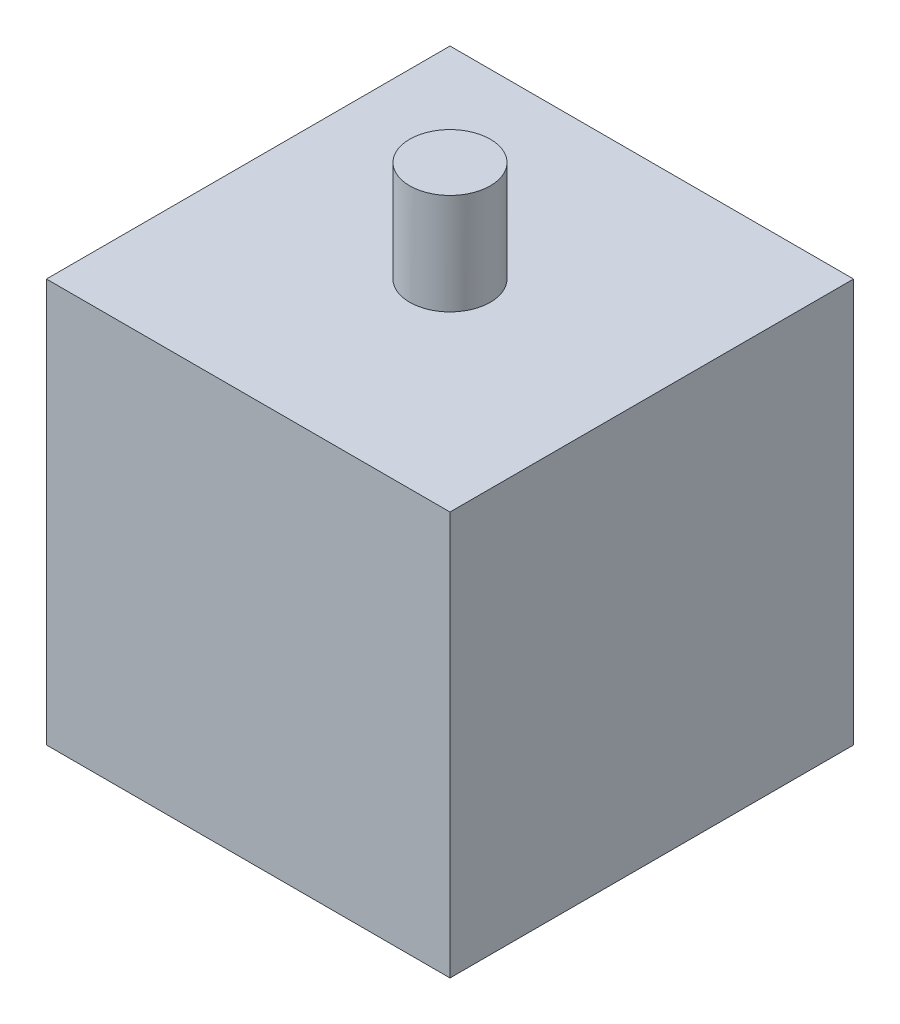
ISO-10303-21;
HEADER;
FILE_DESCRIPTION(('STEP AP214'),'2;1');
FILE_NAME('part.step','',(''),(''),'','','');
FILE_SCHEMA(('AUTOMOTIVE_DESIGN { 1 0 10303 214 1 1 1 1 }'));
ENDSEC;
DATA;
#1=APPLICATION_CONTEXT('core data for automotive mechanical design processes');
#2=APPLICATION_PROTOCOL_DEFINITION('international standard','automotive_design',2000,#1);
#3=PRODUCT_CONTEXT('',#1,'mechanical');
#4=PRODUCT('Part','Part','',(#3));
#5=PRODUCT_RELATED_PRODUCT_CATEGORY('part','',(#4));
#6=PRODUCT_DEFINITION_FORMATION('','',#4);
#7=PRODUCT_DEFINITION_CONTEXT('part definition',#1,'design');
#8=PRODUCT_DEFINITION('design','',#6,#7);
#9=PRODUCT_DEFINITION_SHAPE('','',#8);
#10=(LENGTH_UNIT() NAMED_UNIT(*) SI_UNIT(.MILLI.,.METRE.));
#11=(NAMED_UNIT(*) PLANE_ANGLE_UNIT() SI_UNIT($,.RADIAN.));
#12=(NAMED_UNIT(*) SI_UNIT($,.STERADIAN.) SOLID_ANGLE_UNIT());
#13=UNCERTAINTY_MEASURE_WITH_UNIT(LENGTH_MEASURE(1.E-05),#10,'distance_accuracy_value','');
#14=(GEOMETRIC_REPRESENTATION_CONTEXT(3) GLOBAL_UNCERTAINTY_ASSIGNED_CONTEXT((#13)) GLOBAL_UNIT_ASSIGNED_CONTEXT((#10,
#11,#12)) REPRESENTATION_CONTEXT('',''));
#15=CARTESIAN_POINT('',(0.,0.,0.));
#16=DIRECTION('',(0.,0.,1.));
#17=DIRECTION('',(1.,0.,0.));
#18=AXIS2_PLACEMENT_3D('',#15,#16,#17);
#19=CARTESIAN_POINT('',(0.,100.,0.));
#20=DIRECTION('',(1.,0.,0.));
#21=DIRECTION('',(0.,0.,-1.));
#22=AXIS2_PLACEMENT_3D('',#19,#20,#21);
#23=PLANE('',#22);
#24=DIRECTION('',(0.,0.,1.));
#25=VECTOR('',#24,1.);
#26=CARTESIAN_POINT('',(0.,0.,0.));
#27=LINE('',#26,#25);
#28=CARTESIAN_POINT('',(0.,0.,-100.));
#29=VERTEX_POINT('',#28);
#30=CARTESIAN_POINT('',(0.,0.,0.));
#31=VERTEX_POINT('',#30);
#32=EDGE_CURVE('E109',#29,#31,#27,.T.);
#33=ORIENTED_EDGE('',*,*,#32,.T.);
#34=DIRECTION('',(0.,-1.,0.));
#35=VECTOR('',#34,1.);
#36=CARTESIAN_POINT('',(0.,100.,0.));
#37=LINE('',#36,#35);
#38=CARTESIAN_POINT('',(0.,100.,0.));
#39=VERTEX_POINT('',#38);
#40=EDGE_CURVE('E51',#39,#31,#37,.T.);
#41=ORIENTED_EDGE('',*,*,#40,.F.);
#42=DIRECTION('',(0.,0.,1.));
#43=VECTOR('',#42,1.);
#44=CARTESIAN_POINT('',(0.,100.,0.));
#45=LINE('',#44,#43);
#46=CARTESIAN_POINT('',(0.,100.,-100.));
#47=VERTEX_POINT('',#46);
#48=EDGE_CURVE('E95',#47,#39,#45,.T.);
#49=ORIENTED_EDGE('',*,*,#48,.F.);
#50=DIRECTION('',(0.,-1.,0.));
#51=VECTOR('',#50,1.);
#52=CARTESIAN_POINT('',(0.,100.,-100.));
#53=LINE('',#52,#51);
#54=EDGE_CURVE('E105',#47,#29,#53,.T.);
#55=ORIENTED_EDGE('',*,*,#54,.T.);
#56=EDGE_LOOP('',(#33,#41,#49,#55));
#57=FACE_BOUND('',#56,.T.);
#58=ADVANCED_FACE('F43',(#57),#23,.F.);
#59=CARTESIAN_POINT('',(0.,100.,0.));
#60=DIRECTION('',(0.,0.,-1.));
#61=DIRECTION('',(-1.,0.,0.));
#62=AXIS2_PLACEMENT_3D('',#59,#60,#61);
#63=PLANE('',#62);
#64=DIRECTION('',(1.,0.,0.));
#65=VECTOR('',#64,1.);
#66=CARTESIAN_POINT('',(0.,0.,0.));
#67=LINE('',#66,#65);
#68=CARTESIAN_POINT('',(100.,0.,0.));
#69=VERTEX_POINT('',#68);
#70=EDGE_CURVE('E100',#31,#69,#67,.T.);
#71=ORIENTED_EDGE('',*,*,#70,.T.);
#72=DIRECTION('',(0.,-1.,0.));
#73=VECTOR('',#72,1.);
#74=CARTESIAN_POINT('',(100.,100.,0.));
#75=LINE('',#74,#73);
#76=CARTESIAN_POINT('',(100.,100.,0.));
#77=VERTEX_POINT('',#76);
#78=EDGE_CURVE('E98',#77,#69,#75,.T.);
#79=ORIENTED_EDGE('',*,*,#78,.F.);
#80=DIRECTION('',(1.,0.,0.));
#81=VECTOR('',#80,1.);
#82=CARTESIAN_POINT('',(0.,100.,0.));
#83=LINE('',#82,#81);
#84=EDGE_CURVE('E90',#39,#77,#83,.T.);
#85=ORIENTED_EDGE('',*,*,#84,.F.);
#86=ORIENTED_EDGE('',*,*,#40,.T.);
#87=EDGE_LOOP('',(#71,#79,#85,#86));
#88=FACE_BOUND('',#87,.T.);
#89=ADVANCED_FACE('F99',(#88),#63,.F.);
#90=CARTESIAN_POINT('',(100.,100.,0.));
#91=DIRECTION('',(-1.,0.,0.));
#92=DIRECTION('',(0.,0.,1.));
#93=AXIS2_PLACEMENT_3D('',#90,#91,#92);
#94=PLANE('',#93);
#95=DIRECTION('',(0.,0.,-1.));
#96=VECTOR('',#95,1.);
#97=CARTESIAN_POINT('',(100.,0.,0.));
#98=LINE('',#97,#96);
#99=CARTESIAN_POINT('',(100.,0.,-100.));
#100=VERTEX_POINT('',#99);
#101=EDGE_CURVE('E76',#69,#100,#98,.T.);
#102=ORIENTED_EDGE('',*,*,#101,.T.);
#103=DIRECTION('',(0.,-1.,0.));
#104=VECTOR('',#103,1.);
#105=CARTESIAN_POINT('',(100.,100.,-100.));
#106=LINE('',#105,#104);
#107=CARTESIAN_POINT('',(100.,100.,-100.));
#108=VERTEX_POINT('',#107);
#109=EDGE_CURVE('E101',#108,#100,#106,.T.);
#110=ORIENTED_EDGE('',*,*,#109,.F.);
#111=DIRECTION('',(0.,0.,-1.));
#112=VECTOR('',#111,1.);
#113=CARTESIAN_POINT('',(100.,100.,0.));
#114=LINE('',#113,#112);
#115=EDGE_CURVE('E93',#77,#108,#114,.T.);
#116=ORIENTED_EDGE('',*,*,#115,.F.);
#117=ORIENTED_EDGE('',*,*,#78,.T.);
#118=EDGE_LOOP('',(#102,#110,#116,#117));
#119=FACE_BOUND('',#118,.T.);
#120=ADVANCED_FACE('F103',(#119),#94,.F.);
#121=CARTESIAN_POINT('',(0.,100.,-100.));
#122=DIRECTION('',(0.,0.,1.));
#123=DIRECTION('',(1.,0.,0.));
#124=AXIS2_PLACEMENT_3D('',#121,#122,#123);
#125=PLANE('',#124);
#126=DIRECTION('',(-1.,0.,0.));
#127=VECTOR('',#126,1.);
#128=CARTESIAN_POINT('',(0.,0.,-100.));
#129=LINE('',#128,#127);
#130=EDGE_CURVE('E82',#100,#29,#129,.T.);
#131=ORIENTED_EDGE('',*,*,#130,.T.);
#132=ORIENTED_EDGE('',*,*,#54,.F.);
#133=DIRECTION('',(-1.,0.,0.));
#134=VECTOR('',#133,1.);
#135=CARTESIAN_POINT('',(0.,100.,-100.));
#136=LINE('',#135,#134);
#137=EDGE_CURVE('E59',#108,#47,#136,.T.);
#138=ORIENTED_EDGE('',*,*,#137,.F.);
#139=ORIENTED_EDGE('',*,*,#109,.T.);
#140=EDGE_LOOP('',(#131,#132,#138,#139));
#141=FACE_BOUND('',#140,.T.);
#142=ADVANCED_FACE('F132',(#141),#125,.F.);
#143=CARTESIAN_POINT('',(0.,100.,0.));
#144=DIRECTION('',(0.,-1.,0.));
#145=DIRECTION('',(0.,0.,-1.));
#146=AXIS2_PLACEMENT_3D('',#143,#144,#145);
#147=PLANE('',#146);
#148=CARTESIAN_POINT('',(50.,100.,-50.));
#149=DIRECTION('',(0.,-1.,0.));
#150=DIRECTION('',(0.,0.,-1.));
#151=AXIS2_PLACEMENT_3D('',#148,#149,#150);
#152=CIRCLE('',#151,10.);
#153=CARTESIAN_POINT('',(50.,100.,-60.));
#154=VERTEX_POINT('',#153);
#155=EDGE_CURVE('E11',#154,#154,#152,.F.);
#156=ORIENTED_EDGE('',*,*,#155,.F.);
#157=EDGE_LOOP('',(#156));
#158=FACE_BOUND('',#157,.T.);
#159=ORIENTED_EDGE('',*,*,#48,.T.);
#160=ORIENTED_EDGE('',*,*,#84,.T.);
#161=ORIENTED_EDGE('',*,*,#115,.T.);
#162=ORIENTED_EDGE('',*,*,#137,.T.);
#163=EDGE_LOOP('',(#159,#160,#161,#162));
#164=FACE_BOUND('',#163,.T.);
#165=ADVANCED_FACE('F91',(#158,#164),#147,.F.);
#166=CARTESIAN_POINT('',(0.,0.,0.));
#167=DIRECTION('',(0.,-1.,0.));
#168=DIRECTION('',(0.,0.,-1.));
#169=AXIS2_PLACEMENT_3D('',#166,#167,#168);
#170=PLANE('',#169);
#171=ORIENTED_EDGE('',*,*,#32,.F.);
#172=ORIENTED_EDGE('',*,*,#130,.F.);
#173=ORIENTED_EDGE('',*,*,#101,.F.);
#174=ORIENTED_EDGE('',*,*,#70,.F.);
#175=EDGE_LOOP('',(#171,#172,#173,#174));
#176=FACE_BOUND('',#175,.T.);
#177=ADVANCED_FACE('F120',(#176),#170,.T.);
#178=CARTESIAN_POINT('',(50.,125.,-50.));
#179=DIRECTION('',(0.,-1.,0.));
#180=DIRECTION('',(0.,0.,-1.));
#181=AXIS2_PLACEMENT_3D('',#178,#179,#180);
#182=CYLINDRICAL_SURFACE('',#181,10.);
#183=CARTESIAN_POINT('',(50.,125.,-50.));
#184=DIRECTION('',(0.,1.,0.));
#185=DIRECTION('',(0.,0.,1.));
#186=AXIS2_PLACEMENT_3D('',#183,#184,#185);
#187=CIRCLE('',#186,10.);
#188=CARTESIAN_POINT('',(50.,125.,-40.));
#189=VERTEX_POINT('',#188);
#190=EDGE_CURVE('E112',#189,#189,#187,.T.);
#191=ORIENTED_EDGE('',*,*,#190,.F.);
#192=EDGE_LOOP('',(#191));
#193=FACE_BOUND('',#192,.T.);
#194=ORIENTED_EDGE('',*,*,#155,.T.);
#195=EDGE_LOOP('',(#194));
#196=FACE_BOUND('',#195,.T.);
#197=ADVANCED_FACE('F122',(#193,#196),#182,.T.);
#198=CARTESIAN_POINT('',(50.,125.,-50.));
#199=DIRECTION('',(0.,1.,0.));
#200=DIRECTION('',(0.,0.,1.));
#201=AXIS2_PLACEMENT_3D('',#198,#199,#200);
#202=PLANE('',#201);
#203=ORIENTED_EDGE('',*,*,#190,.T.);
#204=EDGE_LOOP('',(#203));
#205=FACE_BOUND('',#204,.T.);
#206=ADVANCED_FACE('F129',(#205),#202,.T.);
#207=CLOSED_SHELL('',(#58,#89,#120,#142,#165,#177,#197,#206));
#208=MANIFOLD_SOLID_BREP('B2',#207);
#209=ADVANCED_BREP_SHAPE_REPRESENTATION('',(#18,#208),#14);
#210=SHAPE_DEFINITION_REPRESENTATION(#9,#209);
ENDSEC;
END-ISO-10303-21;
